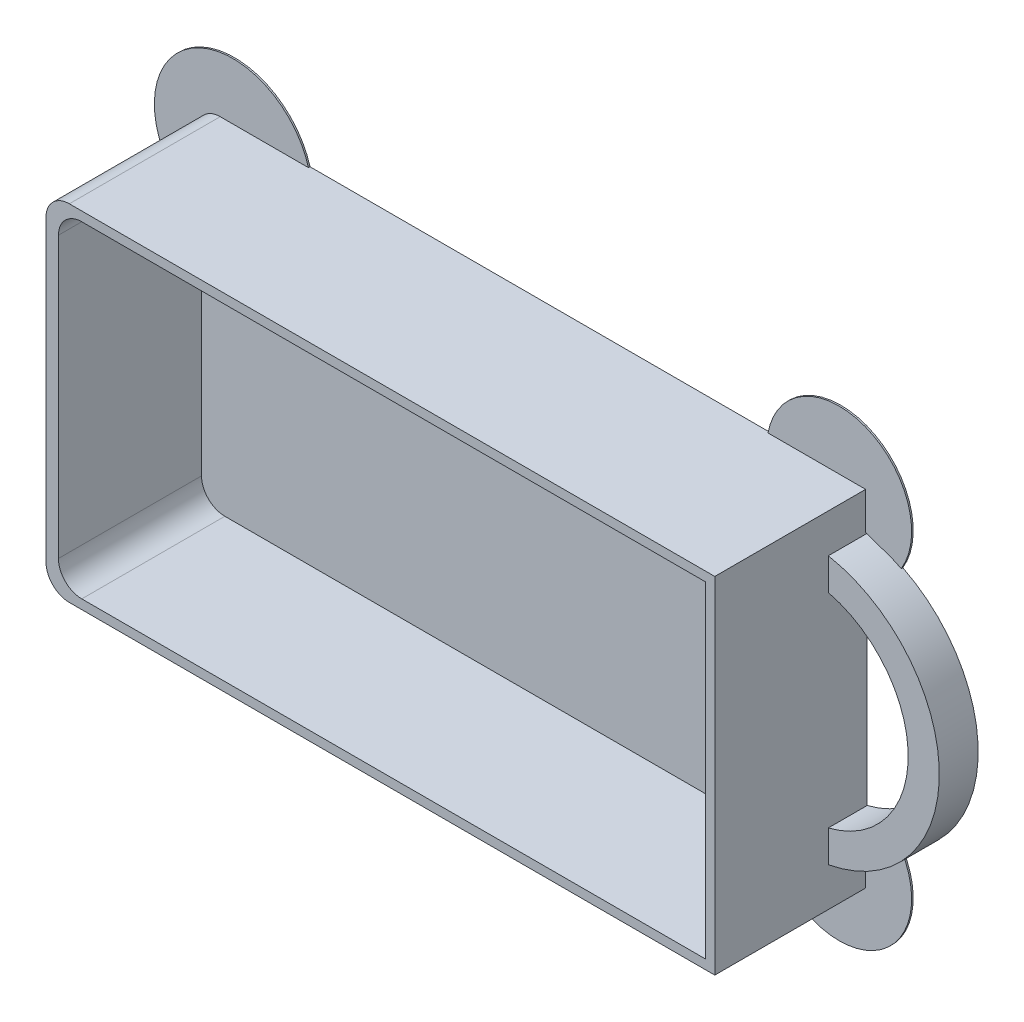
ISO-10303-21;
HEADER;
FILE_DESCRIPTION(('STEP AP214'),'2;1');
FILE_NAME('part.step','',(''),(''),'','','');
FILE_SCHEMA(('AUTOMOTIVE_DESIGN { 1 0 10303 214 1 1 1 1 }'));
ENDSEC;
DATA;
#1=APPLICATION_CONTEXT('core data for automotive mechanical design processes');
#2=APPLICATION_PROTOCOL_DEFINITION('international standard','automotive_design',2000,#1);
#3=PRODUCT_CONTEXT('',#1,'mechanical');
#4=PRODUCT('Part','Part','',(#3));
#5=PRODUCT_RELATED_PRODUCT_CATEGORY('part','',(#4));
#6=PRODUCT_DEFINITION_FORMATION('','',#4);
#7=PRODUCT_DEFINITION_CONTEXT('part definition',#1,'design');
#8=PRODUCT_DEFINITION('design','',#6,#7);
#9=PRODUCT_DEFINITION_SHAPE('','',#8);
#10=(LENGTH_UNIT() NAMED_UNIT(*) SI_UNIT(.MILLI.,.METRE.));
#11=(NAMED_UNIT(*) PLANE_ANGLE_UNIT() SI_UNIT($,.RADIAN.));
#12=(NAMED_UNIT(*) SI_UNIT($,.STERADIAN.) SOLID_ANGLE_UNIT());
#13=UNCERTAINTY_MEASURE_WITH_UNIT(LENGTH_MEASURE(1.E-05),#10,'distance_accuracy_value','');
#14=(GEOMETRIC_REPRESENTATION_CONTEXT(3) GLOBAL_UNCERTAINTY_ASSIGNED_CONTEXT((#13)) GLOBAL_UNIT_ASSIGNED_CONTEXT((#10,
#11,#12)) REPRESENTATION_CONTEXT('',''));
#15=CARTESIAN_POINT('',(0.,0.,0.));
#16=DIRECTION('',(0.,0.,1.));
#17=DIRECTION('',(1.,0.,0.));
#18=AXIS2_PLACEMENT_3D('',#15,#16,#17);
#19=CARTESIAN_POINT('',(-40.,-19.2,19.6));
#20=DIRECTION('',(0.,0.,-1.));
#21=DIRECTION('',(-1.,0.,0.));
#22=AXIS2_PLACEMENT_3D('',#19,#20,#21);
#23=CYLINDRICAL_SURFACE('',#22,3.);
#24=DIRECTION('',(0.,0.,-1.));
#25=VECTOR('',#24,1.);
#26=CARTESIAN_POINT('',(-43.,-19.2,19.6));
#27=LINE('',#26,#25);
#28=CARTESIAN_POINT('',(-43.,-19.2,0.199999999999999));
#29=VERTEX_POINT('',#28);
#30=CARTESIAN_POINT('',(-43.,-19.2,19.6));
#31=VERTEX_POINT('',#30);
#32=EDGE_CURVE('E270',#29,#31,#27,.F.);
#33=ORIENTED_EDGE('',*,*,#32,.F.);
#34=CARTESIAN_POINT('',(-40.,-19.2,0.199999999999999));
#35=DIRECTION('',(0.,0.,-1.));
#36=DIRECTION('',(-1.,0.,0.));
#37=AXIS2_PLACEMENT_3D('',#34,#35,#36);
#38=CIRCLE('',#37,3.);
#39=CARTESIAN_POINT('',(-40.,-22.2,0.199999999999999));
#40=VERTEX_POINT('',#39);
#41=EDGE_CURVE('E12',#29,#40,#38,.F.);
#42=ORIENTED_EDGE('',*,*,#41,.T.);
#43=DIRECTION('',(0.,0.,-1.));
#44=VECTOR('',#43,1.);
#45=CARTESIAN_POINT('',(-40.,-22.2,19.6));
#46=LINE('',#45,#44);
#47=CARTESIAN_POINT('',(-40.,-22.2,19.6));
#48=VERTEX_POINT('',#47);
#49=EDGE_CURVE('E281',#48,#40,#46,.T.);
#50=ORIENTED_EDGE('',*,*,#49,.F.);
#51=CARTESIAN_POINT('',(-40.,-19.2,19.6));
#52=DIRECTION('',(0.,0.,1.));
#53=DIRECTION('',(1.,0.,0.));
#54=AXIS2_PLACEMENT_3D('',#51,#52,#53);
#55=CIRCLE('',#54,3.);
#56=EDGE_CURVE('E277',#31,#48,#55,.T.);
#57=ORIENTED_EDGE('',*,*,#56,.F.);
#58=EDGE_LOOP('',(#33,#42,#50,#57));
#59=FACE_BOUND('',#58,.T.);
#60=ADVANCED_FACE('F41',(#59),#23,.T.);
#61=CARTESIAN_POINT('',(43.,22.2,19.6));
#62=DIRECTION('',(-1.,0.,0.));
#63=DIRECTION('',(0.,-1.,0.));
#64=AXIS2_PLACEMENT_3D('',#61,#62,#63);
#65=PLANE('',#64);
#66=DIRECTION('',(0.,1.,0.));
#67=VECTOR('',#66,1.);
#68=CARTESIAN_POINT('',(43.,22.2,0.));
#69=LINE('',#68,#67);
#70=CARTESIAN_POINT('',(43.,17.2,0.));
#71=VERTEX_POINT('',#70);
#72=CARTESIAN_POINT('',(43.,17.4095957925949,0.));
#73=VERTEX_POINT('',#72);
#74=EDGE_CURVE('E347',#71,#73,#69,.T.);
#75=ORIENTED_EDGE('',*,*,#74,.T.);
#76=DIRECTION('',(0.,0.,1.));
#77=VECTOR('',#76,1.);
#78=CARTESIAN_POINT('',(43.,17.4095957925949,19.6));
#79=LINE('',#78,#77);
#80=CARTESIAN_POINT('',(43.,17.4095957925949,0.199999999999999));
#81=VERTEX_POINT('',#80);
#82=EDGE_CURVE('E56',#73,#81,#79,.T.);
#83=ORIENTED_EDGE('',*,*,#82,.T.);
#84=DIRECTION('',(0.,-1.,0.));
#85=VECTOR('',#84,1.);
#86=CARTESIAN_POINT('',(43.,22.2,0.199999999999999));
#87=LINE('',#86,#85);
#88=CARTESIAN_POINT('',(43.,22.2,0.199999999999999));
#89=VERTEX_POINT('',#88);
#90=EDGE_CURVE('E378',#89,#81,#87,.T.);
#91=ORIENTED_EDGE('',*,*,#90,.F.);
#92=DIRECTION('',(0.,0.,-1.));
#93=VECTOR('',#92,1.);
#94=CARTESIAN_POINT('',(43.,22.2,19.6));
#95=LINE('',#94,#93);
#96=CARTESIAN_POINT('',(43.,22.2,19.6));
#97=VERTEX_POINT('',#96);
#98=EDGE_CURVE('E267',#97,#89,#95,.T.);
#99=ORIENTED_EDGE('',*,*,#98,.F.);
#100=DIRECTION('',(0.,1.,0.));
#101=VECTOR('',#100,1.);
#102=CARTESIAN_POINT('',(43.,22.2,19.6));
#103=LINE('',#102,#101);
#104=CARTESIAN_POINT('',(43.,-22.2,19.6));
#105=VERTEX_POINT('',#104);
#106=EDGE_CURVE('E254',#105,#97,#103,.T.);
#107=ORIENTED_EDGE('',*,*,#106,.F.);
#108=DIRECTION('',(0.,0.,-1.));
#109=VECTOR('',#108,1.);
#110=CARTESIAN_POINT('',(43.,-22.2,19.6));
#111=LINE('',#110,#109);
#112=CARTESIAN_POINT('',(43.,-22.2,0.199999999999999));
#113=VERTEX_POINT('',#112);
#114=EDGE_CURVE('E264',#105,#113,#111,.T.);
#115=ORIENTED_EDGE('',*,*,#114,.T.);
#116=DIRECTION('',(0.,1.,0.));
#117=VECTOR('',#116,1.);
#118=CARTESIAN_POINT('',(43.,22.2,0.199999999999999));
#119=LINE('',#118,#117);
#120=CARTESIAN_POINT('',(43.,-17.4095957925949,0.199999999999999));
#121=VERTEX_POINT('',#120);
#122=EDGE_CURVE('E398',#113,#121,#119,.T.);
#123=ORIENTED_EDGE('',*,*,#122,.T.);
#124=DIRECTION('',(0.,0.,-1.));
#125=VECTOR('',#124,1.);
#126=CARTESIAN_POINT('',(43.,-17.4095957925949,19.6));
#127=LINE('',#126,#125);
#128=CARTESIAN_POINT('',(43.,-17.4095957925949,0.));
#129=VERTEX_POINT('',#128);
#130=EDGE_CURVE('E400',#121,#129,#127,.T.);
#131=ORIENTED_EDGE('',*,*,#130,.T.);
#132=CARTESIAN_POINT('',(43.,-17.2,0.));
#133=VERTEX_POINT('',#132);
#134=EDGE_CURVE('E345',#129,#133,#69,.T.);
#135=ORIENTED_EDGE('',*,*,#134,.T.);
#136=DIRECTION('',(0.,0.,-1.));
#137=VECTOR('',#136,1.);
#138=CARTESIAN_POINT('',(43.,-17.2,5.));
#139=LINE('',#138,#137);
#140=CARTESIAN_POINT('',(43.,-17.2,5.));
#141=VERTEX_POINT('',#140);
#142=EDGE_CURVE('E442',#141,#133,#139,.T.);
#143=ORIENTED_EDGE('',*,*,#142,.F.);
#144=DIRECTION('',(0.,-1.,0.));
#145=VECTOR('',#144,1.);
#146=CARTESIAN_POINT('',(43.,-17.2,5.));
#147=LINE('',#146,#145);
#148=CARTESIAN_POINT('',(43.,-13.1087756865391,5.));
#149=VERTEX_POINT('',#148);
#150=EDGE_CURVE('E439',#149,#141,#147,.T.);
#151=ORIENTED_EDGE('',*,*,#150,.F.);
#152=DIRECTION('',(0.,0.,-1.));
#153=VECTOR('',#152,1.);
#154=CARTESIAN_POINT('',(43.,-13.1087756865391,5.));
#155=LINE('',#154,#153);
#156=CARTESIAN_POINT('',(43.,-13.1087756865391,0.));
#157=VERTEX_POINT('',#156);
#158=EDGE_CURVE('E450',#149,#157,#155,.T.);
#159=ORIENTED_EDGE('',*,*,#158,.T.);
#160=CARTESIAN_POINT('',(43.,13.1087756865391,0.));
#161=VERTEX_POINT('',#160);
#162=EDGE_CURVE('E346',#157,#161,#69,.T.);
#163=ORIENTED_EDGE('',*,*,#162,.T.);
#164=DIRECTION('',(0.,0.,-1.));
#165=VECTOR('',#164,1.);
#166=CARTESIAN_POINT('',(43.,13.1087756865391,5.));
#167=LINE('',#166,#165);
#168=CARTESIAN_POINT('',(43.,13.1087756865391,5.));
#169=VERTEX_POINT('',#168);
#170=EDGE_CURVE('E453',#169,#161,#167,.T.);
#171=ORIENTED_EDGE('',*,*,#170,.F.);
#172=DIRECTION('',(0.,-1.,0.));
#173=VECTOR('',#172,1.);
#174=CARTESIAN_POINT('',(43.,17.2,5.));
#175=LINE('',#174,#173);
#176=CARTESIAN_POINT('',(43.,17.2,5.));
#177=VERTEX_POINT('',#176);
#178=EDGE_CURVE('E432',#177,#169,#175,.T.);
#179=ORIENTED_EDGE('',*,*,#178,.F.);
#180=DIRECTION('',(0.,0.,-1.));
#181=VECTOR('',#180,1.);
#182=CARTESIAN_POINT('',(43.,17.2,5.));
#183=LINE('',#182,#181);
#184=EDGE_CURVE('E456',#177,#71,#183,.T.);
#185=ORIENTED_EDGE('',*,*,#184,.T.);
#186=EDGE_LOOP('',(#75,#83,#91,#99,#107,#115,#123,#131,#135,#143,#151,#159,#163,#171,#179,#185));
#187=FACE_BOUND('',#186,.T.);
#188=ADVANCED_FACE('F460',(#187),#65,.F.);
#189=CARTESIAN_POINT('',(-43.,22.2,19.6));
#190=DIRECTION('',(0.,-1.,0.));
#191=DIRECTION('',(0.,0.,-1.));
#192=AXIS2_PLACEMENT_3D('',#189,#190,#191);
#193=PLANE('',#192);
#194=DIRECTION('',(-1.,0.,0.));
#195=VECTOR('',#194,1.);
#196=CARTESIAN_POINT('',(-43.,22.2,0.));
#197=LINE('',#196,#195);
#198=CARTESIAN_POINT('',(30.4454706503605,22.2,0.));
#199=VERTEX_POINT('',#198);
#200=CARTESIAN_POINT('',(-28.646024870181,22.2,0.));
#201=VERTEX_POINT('',#200);
#202=EDGE_CURVE('E260',#199,#201,#197,.T.);
#203=ORIENTED_EDGE('',*,*,#202,.T.);
#204=DIRECTION('',(0.,0.,-1.));
#205=VECTOR('',#204,1.);
#206=CARTESIAN_POINT('',(-28.646024870181,22.2,0.2));
#207=LINE('',#206,#205);
#208=CARTESIAN_POINT('',(-28.646024870181,22.2,0.2));
#209=VERTEX_POINT('',#208);
#210=EDGE_CURVE('E326',#209,#201,#207,.T.);
#211=ORIENTED_EDGE('',*,*,#210,.F.);
#212=DIRECTION('',(-1.,0.,0.));
#213=VECTOR('',#212,1.);
#214=CARTESIAN_POINT('',(-43.,22.2,0.199999999999999));
#215=LINE('',#214,#213);
#216=CARTESIAN_POINT('',(-40.,22.2,0.199999999999999));
#217=VERTEX_POINT('',#216);
#218=EDGE_CURVE('E315',#209,#217,#215,.T.);
#219=ORIENTED_EDGE('',*,*,#218,.T.);
#220=DIRECTION('',(0.,0.,-1.));
#221=VECTOR('',#220,1.);
#222=CARTESIAN_POINT('',(-40.,22.2,19.6));
#223=LINE('',#222,#221);
#224=CARTESIAN_POINT('',(-40.,22.2,19.6));
#225=VERTEX_POINT('',#224);
#226=EDGE_CURVE('E275',#217,#225,#223,.F.);
#227=ORIENTED_EDGE('',*,*,#226,.T.);
#228=DIRECTION('',(-1.,0.,0.));
#229=VECTOR('',#228,1.);
#230=CARTESIAN_POINT('',(-43.,22.2,19.6));
#231=LINE('',#230,#229);
#232=EDGE_CURVE('E258',#97,#225,#231,.T.);
#233=ORIENTED_EDGE('',*,*,#232,.F.);
#234=ORIENTED_EDGE('',*,*,#98,.T.);
#235=DIRECTION('',(1.,0.,0.));
#236=VECTOR('',#235,1.);
#237=CARTESIAN_POINT('',(-43.,22.2,0.199999999999999));
#238=LINE('',#237,#236);
#239=CARTESIAN_POINT('',(30.4454706503605,22.2,0.199999999999999));
#240=VERTEX_POINT('',#239);
#241=EDGE_CURVE('E64',#240,#89,#238,.T.);
#242=ORIENTED_EDGE('',*,*,#241,.F.);
#243=DIRECTION('',(0.,0.,-1.));
#244=VECTOR('',#243,1.);
#245=CARTESIAN_POINT('',(30.4454706503605,22.2,0.2));
#246=LINE('',#245,#244);
#247=EDGE_CURVE('E327',#240,#199,#246,.T.);
#248=ORIENTED_EDGE('',*,*,#247,.T.);
#249=EDGE_LOOP('',(#203,#211,#219,#227,#233,#234,#242,#248));
#250=FACE_BOUND('',#249,.T.);
#251=ADVANCED_FACE('F324',(#250),#193,.F.);
#252=CARTESIAN_POINT('',(-43.,22.2,19.6));
#253=DIRECTION('',(1.,0.,0.));
#254=DIRECTION('',(0.,1.,0.));
#255=AXIS2_PLACEMENT_3D('',#252,#253,#254);
#256=PLANE('',#255);
#257=DIRECTION('',(0.,-1.,0.));
#258=VECTOR('',#257,1.);
#259=CARTESIAN_POINT('',(-43.,22.2,0.));
#260=LINE('',#259,#258);
#261=CARTESIAN_POINT('',(-43.,10.4177061359249,0.));
#262=VERTEX_POINT('',#261);
#263=CARTESIAN_POINT('',(-43.,-10.4177061359249,0.));
#264=VERTEX_POINT('',#263);
#265=EDGE_CURVE('E255',#262,#264,#260,.T.);
#266=ORIENTED_EDGE('',*,*,#265,.T.);
#267=DIRECTION('',(0.,0.,-1.));
#268=VECTOR('',#267,1.);
#269=CARTESIAN_POINT('',(-43.,-10.4177061359249,0.2));
#270=LINE('',#269,#268);
#271=CARTESIAN_POINT('',(-43.,-10.4177061359249,0.2));
#272=VERTEX_POINT('',#271);
#273=EDGE_CURVE('E234',#272,#264,#270,.T.);
#274=ORIENTED_EDGE('',*,*,#273,.F.);
#275=DIRECTION('',(0.,1.,0.));
#276=VECTOR('',#275,1.);
#277=CARTESIAN_POINT('',(-43.,22.2,0.199999999999999));
#278=LINE('',#277,#276);
#279=EDGE_CURVE('E749',#29,#272,#278,.T.);
#280=ORIENTED_EDGE('',*,*,#279,.F.);
#281=ORIENTED_EDGE('',*,*,#32,.T.);
#282=DIRECTION('',(0.,-1.,0.));
#283=VECTOR('',#282,1.);
#284=CARTESIAN_POINT('',(-43.,22.2,19.6));
#285=LINE('',#284,#283);
#286=CARTESIAN_POINT('',(-43.,19.2,19.6));
#287=VERTEX_POINT('',#286);
#288=EDGE_CURVE('E335',#287,#31,#285,.T.);
#289=ORIENTED_EDGE('',*,*,#288,.F.);
#290=DIRECTION('',(0.,0.,-1.));
#291=VECTOR('',#290,1.);
#292=CARTESIAN_POINT('',(-43.,19.2,19.6));
#293=LINE('',#292,#291);
#294=CARTESIAN_POINT('',(-43.,19.2,0.199999999999999));
#295=VERTEX_POINT('',#294);
#296=EDGE_CURVE('E272',#287,#295,#293,.T.);
#297=ORIENTED_EDGE('',*,*,#296,.T.);
#298=DIRECTION('',(0.,-1.,0.));
#299=VECTOR('',#298,1.);
#300=CARTESIAN_POINT('',(-43.,22.2,0.199999999999999));
#301=LINE('',#300,#299);
#302=CARTESIAN_POINT('',(-43.,10.4177061359249,0.2));
#303=VERTEX_POINT('',#302);
#304=EDGE_CURVE('E318',#295,#303,#301,.T.);
#305=ORIENTED_EDGE('',*,*,#304,.T.);
#306=DIRECTION('',(0.,0.,-1.));
#307=VECTOR('',#306,1.);
#308=CARTESIAN_POINT('',(-43.,10.4177061359249,0.2));
#309=LINE('',#308,#307);
#310=EDGE_CURVE('E360',#303,#262,#309,.T.);
#311=ORIENTED_EDGE('',*,*,#310,.T.);
#312=EDGE_LOOP('',(#266,#274,#280,#281,#289,#297,#305,#311));
#313=FACE_BOUND('',#312,.T.);
#314=ADVANCED_FACE('F338',(#313),#256,.F.);
#315=CARTESIAN_POINT('',(-43.,-22.2,19.6));
#316=DIRECTION('',(0.,1.,0.));
#317=DIRECTION('',(0.,0.,1.));
#318=AXIS2_PLACEMENT_3D('',#315,#316,#317);
#319=PLANE('',#318);
#320=DIRECTION('',(-1.,0.,0.));
#321=VECTOR('',#320,1.);
#322=CARTESIAN_POINT('',(-43.,-22.2,0.199999999999999));
#323=LINE('',#322,#321);
#324=CARTESIAN_POINT('',(-28.646024870181,-22.2,0.2));
#325=VERTEX_POINT('',#324);
#326=EDGE_CURVE('E239',#325,#40,#323,.T.);
#327=ORIENTED_EDGE('',*,*,#326,.F.);
#328=DIRECTION('',(0.,0.,-1.));
#329=VECTOR('',#328,1.);
#330=CARTESIAN_POINT('',(-28.646024870181,-22.2,0.2));
#331=LINE('',#330,#329);
#332=CARTESIAN_POINT('',(-28.646024870181,-22.2,0.));
#333=VERTEX_POINT('',#332);
#334=EDGE_CURVE('E231',#325,#333,#331,.T.);
#335=ORIENTED_EDGE('',*,*,#334,.T.);
#336=DIRECTION('',(1.,0.,0.));
#337=VECTOR('',#336,1.);
#338=CARTESIAN_POINT('',(-43.,-22.2,0.));
#339=LINE('',#338,#337);
#340=CARTESIAN_POINT('',(30.4454706503604,-22.2,0.));
#341=VERTEX_POINT('',#340);
#342=EDGE_CURVE('E245',#333,#341,#339,.T.);
#343=ORIENTED_EDGE('',*,*,#342,.T.);
#344=DIRECTION('',(0.,0.,-1.));
#345=VECTOR('',#344,1.);
#346=CARTESIAN_POINT('',(30.4454706503605,-22.2,0.2));
#347=LINE('',#346,#345);
#348=CARTESIAN_POINT('',(30.4454706503605,-22.2,0.199999999999999));
#349=VERTEX_POINT('',#348);
#350=EDGE_CURVE('E388',#349,#341,#347,.T.);
#351=ORIENTED_EDGE('',*,*,#350,.F.);
#352=DIRECTION('',(1.,0.,0.));
#353=VECTOR('',#352,1.);
#354=CARTESIAN_POINT('',(-43.,-22.2,0.199999999999999));
#355=LINE('',#354,#353);
#356=EDGE_CURVE('E395',#349,#113,#355,.T.);
#357=ORIENTED_EDGE('',*,*,#356,.T.);
#358=ORIENTED_EDGE('',*,*,#114,.F.);
#359=DIRECTION('',(1.,0.,0.));
#360=VECTOR('',#359,1.);
#361=CARTESIAN_POINT('',(-43.,-22.2,19.6));
#362=LINE('',#361,#360);
#363=EDGE_CURVE('E268',#48,#105,#362,.T.);
#364=ORIENTED_EDGE('',*,*,#363,.F.);
#365=ORIENTED_EDGE('',*,*,#49,.T.);
#366=EDGE_LOOP('',(#327,#335,#343,#351,#357,#358,#364,#365));
#367=FACE_BOUND('',#366,.T.);
#368=ADVANCED_FACE('F244',(#367),#319,.F.);
#369=CARTESIAN_POINT('',(0.,0.,19.6));
#370=DIRECTION('',(0.,0.,1.));
#371=DIRECTION('',(1.,0.,0.));
#372=AXIS2_PLACEMENT_3D('',#369,#370,#371);
#373=PLANE('',#372);
#374=DIRECTION('',(0.,-1.,0.));
#375=VECTOR('',#374,1.);
#376=CARTESIAN_POINT('',(-41.4,21.,19.6));
#377=LINE('',#376,#375);
#378=CARTESIAN_POINT('',(-41.4,18.,19.6));
#379=VERTEX_POINT('',#378);
#380=CARTESIAN_POINT('',(-41.4,-18.,19.6));
#381=VERTEX_POINT('',#380);
#382=EDGE_CURVE('E402',#379,#381,#377,.T.);
#383=ORIENTED_EDGE('',*,*,#382,.F.);
#384=CARTESIAN_POINT('',(-38.4,18.,19.6));
#385=DIRECTION('',(0.,0.,1.));
#386=DIRECTION('',(1.,0.,0.));
#387=AXIS2_PLACEMENT_3D('',#384,#385,#386);
#388=CIRCLE('',#387,3.);
#389=CARTESIAN_POINT('',(-38.4,21.,19.6));
#390=VERTEX_POINT('',#389);
#391=EDGE_CURVE('E299',#379,#390,#388,.F.);
#392=ORIENTED_EDGE('',*,*,#391,.T.);
#393=DIRECTION('',(-1.,0.,0.));
#394=VECTOR('',#393,1.);
#395=CARTESIAN_POINT('',(41.8,21.,19.6));
#396=LINE('',#395,#394);
#397=CARTESIAN_POINT('',(41.8,21.,19.6));
#398=VERTEX_POINT('',#397);
#399=EDGE_CURVE('E419',#398,#390,#396,.T.);
#400=ORIENTED_EDGE('',*,*,#399,.F.);
#401=DIRECTION('',(0.,1.,0.));
#402=VECTOR('',#401,1.);
#403=CARTESIAN_POINT('',(41.8,-21.,19.6));
#404=LINE('',#403,#402);
#405=CARTESIAN_POINT('',(41.8,-21.,19.6));
#406=VERTEX_POINT('',#405);
#407=EDGE_CURVE('E416',#406,#398,#404,.T.);
#408=ORIENTED_EDGE('',*,*,#407,.F.);
#409=DIRECTION('',(1.,0.,0.));
#410=VECTOR('',#409,1.);
#411=CARTESIAN_POINT('',(-41.4,-21.,19.6));
#412=LINE('',#411,#410);
#413=CARTESIAN_POINT('',(-38.4,-21.,19.6));
#414=VERTEX_POINT('',#413);
#415=EDGE_CURVE('E414',#414,#406,#412,.T.);
#416=ORIENTED_EDGE('',*,*,#415,.F.);
#417=CARTESIAN_POINT('',(-38.4,-18.,19.6));
#418=DIRECTION('',(0.,0.,1.));
#419=DIRECTION('',(1.,0.,0.));
#420=AXIS2_PLACEMENT_3D('',#417,#418,#419);
#421=CIRCLE('',#420,3.);
#422=EDGE_CURVE('E297',#414,#381,#421,.F.);
#423=ORIENTED_EDGE('',*,*,#422,.T.);
#424=EDGE_LOOP('',(#383,#392,#400,#408,#416,#423));
#425=FACE_BOUND('',#424,.T.);
#426=ORIENTED_EDGE('',*,*,#232,.T.);
#427=CARTESIAN_POINT('',(-40.,19.2,19.6));
#428=DIRECTION('',(0.,0.,1.));
#429=DIRECTION('',(1.,0.,0.));
#430=AXIS2_PLACEMENT_3D('',#427,#428,#429);
#431=CIRCLE('',#430,3.);
#432=EDGE_CURVE('E279',#225,#287,#431,.T.);
#433=ORIENTED_EDGE('',*,*,#432,.T.);
#434=ORIENTED_EDGE('',*,*,#288,.T.);
#435=ORIENTED_EDGE('',*,*,#56,.T.);
#436=ORIENTED_EDGE('',*,*,#363,.T.);
#437=ORIENTED_EDGE('',*,*,#106,.T.);
#438=EDGE_LOOP('',(#426,#433,#434,#435,#436,#437));
#439=FACE_BOUND('',#438,.T.);
#440=ADVANCED_FACE('F334',(#425,#439),#373,.T.);
#441=CARTESIAN_POINT('',(0.,0.,0.));
#442=DIRECTION('',(0.,0.,1.));
#443=DIRECTION('',(1.,0.,0.));
#444=AXIS2_PLACEMENT_3D('',#441,#442,#443);
#445=PLANE('',#444);
#446=CARTESIAN_POINT('',(-38.3580628326126,-19.397220306011,0.));
#447=DIRECTION('',(0.,0.,-1.));
#448=DIRECTION('',(-1.,0.,0.));
#449=AXIS2_PLACEMENT_3D('',#446,#447,#448);
#450=CIRCLE('',#449,10.1083755073083);
#451=EDGE_CURVE('E227',#333,#264,#450,.T.);
#452=ORIENTED_EDGE('',*,*,#451,.T.);
#453=ORIENTED_EDGE('',*,*,#265,.F.);
#454=CARTESIAN_POINT('',(-38.3580628326126,19.397220306011,0.));
#455=DIRECTION('',(0.,0.,-1.));
#456=DIRECTION('',(1.,0.,0.));
#457=AXIS2_PLACEMENT_3D('',#454,#455,#456);
#458=CIRCLE('',#457,10.1083755073083);
#459=EDGE_CURVE('E352',#262,#201,#458,.T.);
#460=ORIENTED_EDGE('',*,*,#459,.T.);
#461=ORIENTED_EDGE('',*,*,#202,.F.);
#462=CARTESIAN_POINT('',(39.5980407277722,20.4606266128769,0.));
#463=DIRECTION('',(0.,0.,-1.));
#464=DIRECTION('',(-1.,0.,0.));
#465=AXIS2_PLACEMENT_3D('',#462,#463,#464);
#466=CIRCLE('',#465,9.31638120740904);
#467=CARTESIAN_POINT('',(47.5828841665883,15.6609147403414,0.));
#468=VERTEX_POINT('',#467);
#469=EDGE_CURVE('E351',#199,#468,#466,.T.);
#470=ORIENTED_EDGE('',*,*,#469,.T.);
#471=CARTESIAN_POINT('',(39.7735468390197,0.,0.));
#472=DIRECTION('',(0.,0.,1.));
#473=DIRECTION('',(1.,0.,0.));
#474=AXIS2_PLACEMENT_3D('',#471,#472,#473);
#475=CIRCLE('',#474,17.5);
#476=CARTESIAN_POINT('',(47.5828841665884,-15.6609147403414,0.));
#477=VERTEX_POINT('',#476);
#478=EDGE_CURVE('E445',#477,#468,#475,.T.);
#479=ORIENTED_EDGE('',*,*,#478,.F.);
#480=CARTESIAN_POINT('',(39.5980407277722,-20.4606266128769,0.));
#481=DIRECTION('',(0.,0.,-1.));
#482=DIRECTION('',(1.,0.,0.));
#483=AXIS2_PLACEMENT_3D('',#480,#481,#482);
#484=CIRCLE('',#483,9.31638120740904);
#485=EDGE_CURVE('E253',#477,#341,#484,.T.);
#486=ORIENTED_EDGE('',*,*,#485,.T.);
#487=ORIENTED_EDGE('',*,*,#342,.F.);
#488=EDGE_LOOP('',(#452,#453,#460,#461,#470,#479,#486,#487));
#489=FACE_BOUND('',#488,.T.);
#490=DIRECTION('',(-0.934296316736965,0.356497394845658,0.));
#491=VECTOR('',#490,1.);
#492=CARTESIAN_POINT('',(47.5828841665884,15.6609147403414,0.));
#493=LINE('',#492,#491);
#494=CARTESIAN_POINT('',(44.3816863928052,16.8823887484217,0.));
#495=VERTEX_POINT('',#494);
#496=EDGE_CURVE('E368',#495,#73,#493,.T.);
#497=ORIENTED_EDGE('',*,*,#496,.T.);
#498=ORIENTED_EDGE('',*,*,#74,.F.);
#499=EDGE_CURVE('E428',#495,#71,#475,.T.);
#500=ORIENTED_EDGE('',*,*,#499,.F.);
#501=EDGE_LOOP('',(#497,#498,#500));
#502=FACE_BOUND('',#501,.T.);
#503=ORIENTED_EDGE('',*,*,#134,.F.);
#504=DIRECTION('',(0.934296316736965,0.356497394845658,0.));
#505=VECTOR('',#504,1.);
#506=CARTESIAN_POINT('',(47.5828841665884,-15.6609147403414,0.));
#507=LINE('',#506,#505);
#508=CARTESIAN_POINT('',(44.3816863928052,-16.8823887484217,0.));
#509=VERTEX_POINT('',#508);
#510=EDGE_CURVE('E385',#129,#509,#507,.T.);
#511=ORIENTED_EDGE('',*,*,#510,.T.);
#512=EDGE_CURVE('E443',#133,#509,#475,.T.);
#513=ORIENTED_EDGE('',*,*,#512,.F.);
#514=EDGE_LOOP('',(#503,#511,#513));
#515=FACE_BOUND('',#514,.T.);
#516=CARTESIAN_POINT('',(39.7735468390197,0.,0.));
#517=DIRECTION('',(0.,0.,-1.));
#518=DIRECTION('',(1.,0.,0.));
#519=AXIS2_PLACEMENT_3D('',#516,#517,#518);
#520=CIRCLE('',#519,13.5);
#521=EDGE_CURVE('E433',#161,#157,#520,.T.);
#522=ORIENTED_EDGE('',*,*,#521,.F.);
#523=ORIENTED_EDGE('',*,*,#162,.F.);
#524=EDGE_LOOP('',(#522,#523));
#525=FACE_BOUND('',#524,.T.);
#526=ADVANCED_FACE('F250',(#489,#502,#515,#525),#445,.F.);
#527=CARTESIAN_POINT('',(39.7735468390197,0.,5.));
#528=DIRECTION('',(0.,0.,-1.));
#529=DIRECTION('',(-1.,0.,0.));
#530=AXIS2_PLACEMENT_3D('',#527,#528,#529);
#531=CYLINDRICAL_SURFACE('',#530,17.5);
#532=CARTESIAN_POINT('',(39.7735468390197,0.,0.2));
#533=DIRECTION('',(0.,0.,-1.));
#534=DIRECTION('',(-1.,0.,0.));
#535=AXIS2_PLACEMENT_3D('',#532,#533,#534);
#536=CIRCLE('',#535,17.5);
#537=CARTESIAN_POINT('',(44.3816863928052,16.8823887484217,0.2));
#538=VERTEX_POINT('',#537);
#539=CARTESIAN_POINT('',(47.5828841665883,15.6609147403414,0.2));
#540=VERTEX_POINT('',#539);
#541=EDGE_CURVE('E305',#538,#540,#536,.T.);
#542=ORIENTED_EDGE('',*,*,#541,.F.);
#543=DIRECTION('',(0.,0.,-1.));
#544=VECTOR('',#543,1.);
#545=CARTESIAN_POINT('',(44.3816863928052,16.8823887484217,5.));
#546=LINE('',#545,#544);
#547=EDGE_CURVE('E308',#538,#495,#546,.T.);
#548=ORIENTED_EDGE('',*,*,#547,.T.);
#549=ORIENTED_EDGE('',*,*,#499,.T.);
#550=ORIENTED_EDGE('',*,*,#184,.F.);
#551=CARTESIAN_POINT('',(39.7735468390197,0.,5.));
#552=DIRECTION('',(0.,0.,1.));
#553=DIRECTION('',(1.,0.,0.));
#554=AXIS2_PLACEMENT_3D('',#551,#552,#553);
#555=CIRCLE('',#554,17.5);
#556=EDGE_CURVE('E429',#141,#177,#555,.T.);
#557=ORIENTED_EDGE('',*,*,#556,.F.);
#558=ORIENTED_EDGE('',*,*,#142,.T.);
#559=ORIENTED_EDGE('',*,*,#512,.T.);
#560=DIRECTION('',(0.,0.,-1.));
#561=VECTOR('',#560,1.);
#562=CARTESIAN_POINT('',(44.3816863928052,-16.8823887484217,5.));
#563=LINE('',#562,#561);
#564=CARTESIAN_POINT('',(44.3816863928052,-16.8823887484217,0.2));
#565=VERTEX_POINT('',#564);
#566=EDGE_CURVE('E303',#509,#565,#563,.F.);
#567=ORIENTED_EDGE('',*,*,#566,.T.);
#568=CARTESIAN_POINT('',(39.7735468390197,0.,0.2));
#569=DIRECTION('',(0.,0.,1.));
#570=DIRECTION('',(1.,0.,0.));
#571=AXIS2_PLACEMENT_3D('',#568,#569,#570);
#572=CIRCLE('',#571,17.5);
#573=CARTESIAN_POINT('',(47.5828841665883,-15.6609147403414,0.2));
#574=VERTEX_POINT('',#573);
#575=EDGE_CURVE('E301',#565,#574,#572,.T.);
#576=ORIENTED_EDGE('',*,*,#575,.T.);
#577=DIRECTION('',(0.,0.,-1.));
#578=VECTOR('',#577,1.);
#579=CARTESIAN_POINT('',(47.5828841665884,-15.6609147403414,0.2));
#580=LINE('',#579,#578);
#581=EDGE_CURVE('E392',#574,#477,#580,.T.);
#582=ORIENTED_EDGE('',*,*,#581,.T.);
#583=ORIENTED_EDGE('',*,*,#478,.T.);
#584=DIRECTION('',(0.,0.,-1.));
#585=VECTOR('',#584,1.);
#586=CARTESIAN_POINT('',(47.5828841665884,15.6609147403414,0.2));
#587=LINE('',#586,#585);
#588=EDGE_CURVE('E363',#540,#468,#587,.T.);
#589=ORIENTED_EDGE('',*,*,#588,.F.);
#590=EDGE_LOOP('',(#542,#548,#549,#550,#557,#558,#559,#567,#576,#582,#583,#589));
#591=FACE_BOUND('',#590,.T.);
#592=ADVANCED_FACE('F468',(#591),#531,.T.);
#593=CARTESIAN_POINT('',(39.7735468390197,0.,5.));
#594=DIRECTION('',(0.,0.,-1.));
#595=DIRECTION('',(-1.,0.,0.));
#596=AXIS2_PLACEMENT_3D('',#593,#594,#595);
#597=CYLINDRICAL_SURFACE('',#596,13.5);
#598=ORIENTED_EDGE('',*,*,#521,.T.);
#599=ORIENTED_EDGE('',*,*,#158,.F.);
#600=CARTESIAN_POINT('',(39.7735468390197,0.,5.));
#601=DIRECTION('',(0.,0.,-1.));
#602=DIRECTION('',(1.,0.,0.));
#603=AXIS2_PLACEMENT_3D('',#600,#601,#602);
#604=CIRCLE('',#603,13.5);
#605=EDGE_CURVE('E436',#169,#149,#604,.T.);
#606=ORIENTED_EDGE('',*,*,#605,.F.);
#607=ORIENTED_EDGE('',*,*,#170,.T.);
#608=EDGE_LOOP('',(#598,#599,#606,#607));
#609=FACE_BOUND('',#608,.T.);
#610=ADVANCED_FACE('F466',(#609),#597,.F.);
#611=CARTESIAN_POINT('',(39.7735468390197,0.,5.));
#612=DIRECTION('',(0.,0.,1.));
#613=DIRECTION('',(1.,0.,0.));
#614=AXIS2_PLACEMENT_3D('',#611,#612,#613);
#615=PLANE('',#614);
#616=ORIENTED_EDGE('',*,*,#556,.T.);
#617=ORIENTED_EDGE('',*,*,#178,.T.);
#618=ORIENTED_EDGE('',*,*,#605,.T.);
#619=ORIENTED_EDGE('',*,*,#150,.T.);
#620=EDGE_LOOP('',(#616,#617,#618,#619));
#621=FACE_BOUND('',#620,.T.);
#622=ADVANCED_FACE('F527',(#621),#615,.T.);
#623=CARTESIAN_POINT('',(-41.4,21.,-93.2));
#624=DIRECTION('',(-1.,0.,0.));
#625=DIRECTION('',(0.,-1.,0.));
#626=AXIS2_PLACEMENT_3D('',#623,#624,#625);
#627=PLANE('',#626);
#628=ORIENTED_EDGE('',*,*,#382,.T.);
#629=DIRECTION('',(0.,0.,1.));
#630=VECTOR('',#629,1.);
#631=CARTESIAN_POINT('',(-41.4,-18.,1.20000000000001));
#632=LINE('',#631,#630);
#633=CARTESIAN_POINT('',(-41.4,-18.,1.20000000000001));
#634=VERTEX_POINT('',#633);
#635=EDGE_CURVE('E289',#381,#634,#632,.F.);
#636=ORIENTED_EDGE('',*,*,#635,.T.);
#637=DIRECTION('',(0.,1.,0.));
#638=VECTOR('',#637,1.);
#639=CARTESIAN_POINT('',(-41.4,21.,1.20000000000001));
#640=LINE('',#639,#638);
#641=CARTESIAN_POINT('',(-41.4,18.,1.20000000000001));
#642=VERTEX_POINT('',#641);
#643=EDGE_CURVE('E408',#634,#642,#640,.T.);
#644=ORIENTED_EDGE('',*,*,#643,.T.);
#645=DIRECTION('',(0.,0.,1.));
#646=VECTOR('',#645,1.);
#647=CARTESIAN_POINT('',(-41.4,18.,19.6));
#648=LINE('',#647,#646);
#649=EDGE_CURVE('E286',#642,#379,#648,.T.);
#650=ORIENTED_EDGE('',*,*,#649,.T.);
#651=EDGE_LOOP('',(#628,#636,#644,#650));
#652=FACE_BOUND('',#651,.T.);
#653=ADVANCED_FACE('F525',(#652),#627,.F.);
#654=CARTESIAN_POINT('',(41.8,21.,-93.2));
#655=DIRECTION('',(0.,1.,0.));
#656=DIRECTION('',(0.,0.,1.));
#657=AXIS2_PLACEMENT_3D('',#654,#655,#656);
#658=PLANE('',#657);
#659=ORIENTED_EDGE('',*,*,#399,.T.);
#660=DIRECTION('',(0.,0.,1.));
#661=VECTOR('',#660,1.);
#662=CARTESIAN_POINT('',(-38.4,21.,1.20000000000001));
#663=LINE('',#662,#661);
#664=CARTESIAN_POINT('',(-38.4,21.,1.20000000000001));
#665=VERTEX_POINT('',#664);
#666=EDGE_CURVE('E295',#390,#665,#663,.F.);
#667=ORIENTED_EDGE('',*,*,#666,.T.);
#668=DIRECTION('',(1.,0.,0.));
#669=VECTOR('',#668,1.);
#670=CARTESIAN_POINT('',(41.8,21.,1.20000000000001));
#671=LINE('',#670,#669);
#672=CARTESIAN_POINT('',(41.8,21.,1.20000000000001));
#673=VERTEX_POINT('',#672);
#674=EDGE_CURVE('E405',#665,#673,#671,.T.);
#675=ORIENTED_EDGE('',*,*,#674,.T.);
#676=DIRECTION('',(0.,0.,1.));
#677=VECTOR('',#676,1.);
#678=CARTESIAN_POINT('',(41.8,21.,-93.2));
#679=LINE('',#678,#677);
#680=EDGE_CURVE('E406',#673,#398,#679,.T.);
#681=ORIENTED_EDGE('',*,*,#680,.T.);
#682=EDGE_LOOP('',(#659,#667,#675,#681));
#683=FACE_BOUND('',#682,.T.);
#684=ADVANCED_FACE('F520',(#683),#658,.F.);
#685=CARTESIAN_POINT('',(41.8,-21.,-93.2));
#686=DIRECTION('',(1.,0.,0.));
#687=DIRECTION('',(0.,1.,0.));
#688=AXIS2_PLACEMENT_3D('',#685,#686,#687);
#689=PLANE('',#688);
#690=DIRECTION('',(0.,-1.,0.));
#691=VECTOR('',#690,1.);
#692=CARTESIAN_POINT('',(41.8,-21.,1.20000000000001));
#693=LINE('',#692,#691);
#694=CARTESIAN_POINT('',(41.8,-21.,1.19999999999998));
#695=VERTEX_POINT('',#694);
#696=EDGE_CURVE('E403',#673,#695,#693,.T.);
#697=ORIENTED_EDGE('',*,*,#696,.T.);
#698=DIRECTION('',(0.,0.,1.));
#699=VECTOR('',#698,1.);
#700=CARTESIAN_POINT('',(41.8,-21.,-93.2));
#701=LINE('',#700,#699);
#702=EDGE_CURVE('E422',#695,#406,#701,.T.);
#703=ORIENTED_EDGE('',*,*,#702,.T.);
#704=ORIENTED_EDGE('',*,*,#407,.T.);
#705=ORIENTED_EDGE('',*,*,#680,.F.);
#706=EDGE_LOOP('',(#697,#703,#704,#705));
#707=FACE_BOUND('',#706,.T.);
#708=ADVANCED_FACE('F514',(#707),#689,.F.);
#709=CARTESIAN_POINT('',(-41.4,-21.,-93.2));
#710=DIRECTION('',(0.,-1.,0.));
#711=DIRECTION('',(0.,0.,-1.));
#712=AXIS2_PLACEMENT_3D('',#709,#710,#711);
#713=PLANE('',#712);
#714=DIRECTION('',(-1.,0.,0.));
#715=VECTOR('',#714,1.);
#716=CARTESIAN_POINT('',(-41.4,-21.,1.20000000000001));
#717=LINE('',#716,#715);
#718=CARTESIAN_POINT('',(-38.4,-21.,1.20000000000001));
#719=VERTEX_POINT('',#718);
#720=EDGE_CURVE('E411',#695,#719,#717,.T.);
#721=ORIENTED_EDGE('',*,*,#720,.T.);
#722=DIRECTION('',(0.,0.,1.));
#723=VECTOR('',#722,1.);
#724=CARTESIAN_POINT('',(-38.4,-21.,19.6));
#725=LINE('',#724,#723);
#726=EDGE_CURVE('E283',#719,#414,#725,.T.);
#727=ORIENTED_EDGE('',*,*,#726,.T.);
#728=ORIENTED_EDGE('',*,*,#415,.T.);
#729=ORIENTED_EDGE('',*,*,#702,.F.);
#730=EDGE_LOOP('',(#721,#727,#728,#729));
#731=FACE_BOUND('',#730,.T.);
#732=ADVANCED_FACE('F510',(#731),#713,.F.);
#733=CARTESIAN_POINT('',(0.,0.,1.2));
#734=DIRECTION('',(0.,0.,1.));
#735=DIRECTION('',(1.,0.,0.));
#736=AXIS2_PLACEMENT_3D('',#733,#734,#735);
#737=PLANE('',#736);
#738=ORIENTED_EDGE('',*,*,#643,.F.);
#739=CARTESIAN_POINT('',(-38.4,-18.,1.20000000000001));
#740=DIRECTION('',(0.,0.,1.));
#741=DIRECTION('',(1.,0.,0.));
#742=AXIS2_PLACEMENT_3D('',#739,#740,#741);
#743=CIRCLE('',#742,3.);
#744=EDGE_CURVE('E293',#634,#719,#743,.T.);
#745=ORIENTED_EDGE('',*,*,#744,.T.);
#746=ORIENTED_EDGE('',*,*,#720,.F.);
#747=ORIENTED_EDGE('',*,*,#696,.F.);
#748=ORIENTED_EDGE('',*,*,#674,.F.);
#749=CARTESIAN_POINT('',(-38.4,18.,1.20000000000001));
#750=DIRECTION('',(0.,0.,1.));
#751=DIRECTION('',(1.,0.,0.));
#752=AXIS2_PLACEMENT_3D('',#749,#750,#751);
#753=CIRCLE('',#752,3.);
#754=EDGE_CURVE('E291',#665,#642,#753,.T.);
#755=ORIENTED_EDGE('',*,*,#754,.T.);
#756=EDGE_LOOP('',(#738,#745,#746,#747,#748,#755));
#757=FACE_BOUND('',#756,.T.);
#758=ADVANCED_FACE('F500',(#757),#737,.T.);
#759=CARTESIAN_POINT('',(-40.,19.2,19.6));
#760=DIRECTION('',(0.,0.,-1.));
#761=DIRECTION('',(-1.,0.,0.));
#762=AXIS2_PLACEMENT_3D('',#759,#760,#761);
#763=CYLINDRICAL_SURFACE('',#762,3.);
#764=CARTESIAN_POINT('',(-40.,19.2,0.199999999999999));
#765=DIRECTION('',(0.,0.,1.));
#766=DIRECTION('',(1.,0.,0.));
#767=AXIS2_PLACEMENT_3D('',#764,#765,#766);
#768=CIRCLE('',#767,3.);
#769=EDGE_CURVE('E49',#295,#217,#768,.F.);
#770=ORIENTED_EDGE('',*,*,#769,.F.);
#771=ORIENTED_EDGE('',*,*,#296,.F.);
#772=ORIENTED_EDGE('',*,*,#432,.F.);
#773=ORIENTED_EDGE('',*,*,#226,.F.);
#774=EDGE_LOOP('',(#770,#771,#772,#773));
#775=FACE_BOUND('',#774,.T.);
#776=ADVANCED_FACE('F330',(#775),#763,.T.);
#777=CARTESIAN_POINT('',(-38.4,-18.,-93.2));
#778=DIRECTION('',(0.,0.,-1.));
#779=DIRECTION('',(-1.,0.,0.));
#780=AXIS2_PLACEMENT_3D('',#777,#778,#779);
#781=CYLINDRICAL_SURFACE('',#780,3.);
#782=ORIENTED_EDGE('',*,*,#744,.F.);
#783=ORIENTED_EDGE('',*,*,#635,.F.);
#784=ORIENTED_EDGE('',*,*,#422,.F.);
#785=ORIENTED_EDGE('',*,*,#726,.F.);
#786=EDGE_LOOP('',(#782,#783,#784,#785));
#787=FACE_BOUND('',#786,.T.);
#788=ADVANCED_FACE('F490',(#787),#781,.F.);
#789=CARTESIAN_POINT('',(-38.4,18.,-93.2));
#790=DIRECTION('',(0.,0.,-1.));
#791=DIRECTION('',(-1.,0.,0.));
#792=AXIS2_PLACEMENT_3D('',#789,#790,#791);
#793=CYLINDRICAL_SURFACE('',#792,3.);
#794=ORIENTED_EDGE('',*,*,#754,.F.);
#795=ORIENTED_EDGE('',*,*,#666,.F.);
#796=ORIENTED_EDGE('',*,*,#391,.F.);
#797=ORIENTED_EDGE('',*,*,#649,.F.);
#798=EDGE_LOOP('',(#794,#795,#796,#797));
#799=FACE_BOUND('',#798,.T.);
#800=ADVANCED_FACE('F43',(#799),#793,.F.);
#801=CARTESIAN_POINT('',(47.5828841665884,-15.6609147403414,0.2));
#802=DIRECTION('',(-0.356497394845658,0.934296316736965,0.));
#803=DIRECTION('',(-0.934296316736965,-0.356497394845658,0.));
#804=AXIS2_PLACEMENT_3D('',#801,#802,#803);
#805=PLANE('',#804);
#806=ORIENTED_EDGE('',*,*,#130,.F.);
#807=DIRECTION('',(0.934296316736965,0.356497394845658,0.));
#808=VECTOR('',#807,1.);
#809=CARTESIAN_POINT('',(47.5828841665884,-15.6609147403414,0.2));
#810=LINE('',#809,#808);
#811=EDGE_CURVE('E384',#121,#565,#810,.T.);
#812=ORIENTED_EDGE('',*,*,#811,.T.);
#813=ORIENTED_EDGE('',*,*,#566,.F.);
#814=ORIENTED_EDGE('',*,*,#510,.F.);
#815=EDGE_LOOP('',(#806,#812,#813,#814));
#816=FACE_BOUND('',#815,.T.);
#817=ADVANCED_FACE('F497',(#816),#805,.T.);
#818=CARTESIAN_POINT('',(39.5980407277722,-20.4606266128769,0.2));
#819=DIRECTION('',(0.,0.,-1.));
#820=DIRECTION('',(-1.,0.,0.));
#821=AXIS2_PLACEMENT_3D('',#818,#819,#820);
#822=CYLINDRICAL_SURFACE('',#821,9.31638120740904);
#823=ORIENTED_EDGE('',*,*,#485,.F.);
#824=ORIENTED_EDGE('',*,*,#581,.F.);
#825=CARTESIAN_POINT('',(39.5980407277722,-20.4606266128769,0.2));
#826=DIRECTION('',(0.,0.,-1.));
#827=DIRECTION('',(1.,0.,0.));
#828=AXIS2_PLACEMENT_3D('',#825,#826,#827);
#829=CIRCLE('',#828,9.31638120740904);
#830=EDGE_CURVE('E381',#574,#349,#829,.T.);
#831=ORIENTED_EDGE('',*,*,#830,.T.);
#832=ORIENTED_EDGE('',*,*,#350,.T.);
#833=EDGE_LOOP('',(#823,#824,#831,#832));
#834=FACE_BOUND('',#833,.T.);
#835=ADVANCED_FACE('F642',(#834),#822,.T.);
#836=CARTESIAN_POINT('',(39.5980407277722,-20.4606266128769,0.2));
#837=DIRECTION('',(0.,0.,1.));
#838=DIRECTION('',(1.,0.,0.));
#839=AXIS2_PLACEMENT_3D('',#836,#837,#838);
#840=PLANE('',#839);
#841=ORIENTED_EDGE('',*,*,#122,.F.);
#842=ORIENTED_EDGE('',*,*,#356,.F.);
#843=ORIENTED_EDGE('',*,*,#830,.F.);
#844=ORIENTED_EDGE('',*,*,#575,.F.);
#845=ORIENTED_EDGE('',*,*,#811,.F.);
#846=EDGE_LOOP('',(#841,#842,#843,#844,#845));
#847=FACE_BOUND('',#846,.T.);
#848=ADVANCED_FACE('F653',(#847),#840,.T.);
#849=CARTESIAN_POINT('',(47.5828841665884,15.6609147403414,0.2));
#850=DIRECTION('',(-0.356497394845658,-0.934296316736965,0.));
#851=DIRECTION('',(0.934296316736965,-0.356497394845658,0.));
#852=AXIS2_PLACEMENT_3D('',#849,#850,#851);
#853=PLANE('',#852);
#854=ORIENTED_EDGE('',*,*,#82,.F.);
#855=ORIENTED_EDGE('',*,*,#496,.F.);
#856=ORIENTED_EDGE('',*,*,#547,.F.);
#857=DIRECTION('',(-0.934296316736965,0.356497394845658,0.));
#858=VECTOR('',#857,1.);
#859=CARTESIAN_POINT('',(47.5828841665884,15.6609147403414,0.2));
#860=LINE('',#859,#858);
#861=EDGE_CURVE('E366',#538,#81,#860,.T.);
#862=ORIENTED_EDGE('',*,*,#861,.T.);
#863=EDGE_LOOP('',(#854,#855,#856,#862));
#864=FACE_BOUND('',#863,.T.);
#865=ADVANCED_FACE('F664',(#864),#853,.T.);
#866=CARTESIAN_POINT('',(39.5980407277722,20.4606266128769,0.2));
#867=DIRECTION('',(0.,0.,-1.));
#868=DIRECTION('',(-1.,0.,0.));
#869=AXIS2_PLACEMENT_3D('',#866,#867,#868);
#870=CYLINDRICAL_SURFACE('',#869,9.31638120740904);
#871=ORIENTED_EDGE('',*,*,#469,.F.);
#872=ORIENTED_EDGE('',*,*,#247,.F.);
#873=CARTESIAN_POINT('',(39.5980407277722,20.4606266128769,0.2));
#874=DIRECTION('',(0.,0.,-1.));
#875=DIRECTION('',(-1.,0.,0.));
#876=AXIS2_PLACEMENT_3D('',#873,#874,#875);
#877=CIRCLE('',#876,9.31638120740904);
#878=EDGE_CURVE('E371',#240,#540,#877,.T.);
#879=ORIENTED_EDGE('',*,*,#878,.T.);
#880=ORIENTED_EDGE('',*,*,#588,.T.);
#881=EDGE_LOOP('',(#871,#872,#879,#880));
#882=FACE_BOUND('',#881,.T.);
#883=ADVANCED_FACE('F675',(#882),#870,.T.);
#884=CARTESIAN_POINT('',(39.5980407277722,20.4606266128769,0.2));
#885=DIRECTION('',(0.,0.,-1.));
#886=DIRECTION('',(-1.,0.,0.));
#887=AXIS2_PLACEMENT_3D('',#884,#885,#886);
#888=PLANE('',#887);
#889=ORIENTED_EDGE('',*,*,#241,.T.);
#890=ORIENTED_EDGE('',*,*,#90,.T.);
#891=ORIENTED_EDGE('',*,*,#861,.F.);
#892=ORIENTED_EDGE('',*,*,#541,.T.);
#893=ORIENTED_EDGE('',*,*,#878,.F.);
#894=EDGE_LOOP('',(#889,#890,#891,#892,#893));
#895=FACE_BOUND('',#894,.T.);
#896=ADVANCED_FACE('F686',(#895),#888,.F.);
#897=CARTESIAN_POINT('',(-38.3580628326126,19.397220306011,0.2));
#898=DIRECTION('',(0.,0.,1.));
#899=DIRECTION('',(1.,0.,0.));
#900=AXIS2_PLACEMENT_3D('',#897,#898,#899);
#901=PLANE('',#900);
#902=ORIENTED_EDGE('',*,*,#218,.F.);
#903=CARTESIAN_POINT('',(-38.3580628326126,19.397220306011,0.2));
#904=DIRECTION('',(0.,0.,-1.));
#905=DIRECTION('',(1.,0.,0.));
#906=AXIS2_PLACEMENT_3D('',#903,#904,#905);
#907=CIRCLE('',#906,10.1083755073083);
#908=EDGE_CURVE('E355',#303,#209,#907,.T.);
#909=ORIENTED_EDGE('',*,*,#908,.F.);
#910=ORIENTED_EDGE('',*,*,#304,.F.);
#911=ORIENTED_EDGE('',*,*,#769,.T.);
#912=EDGE_LOOP('',(#902,#909,#910,#911));
#913=FACE_BOUND('',#912,.T.);
#914=ADVANCED_FACE('F313',(#913),#901,.T.);
#915=CARTESIAN_POINT('',(-38.3580628326126,19.397220306011,0.2));
#916=DIRECTION('',(0.,0.,-1.));
#917=DIRECTION('',(-1.,0.,0.));
#918=AXIS2_PLACEMENT_3D('',#915,#916,#917);
#919=CYLINDRICAL_SURFACE('',#918,10.1083755073083);
#920=ORIENTED_EDGE('',*,*,#459,.F.);
#921=ORIENTED_EDGE('',*,*,#310,.F.);
#922=ORIENTED_EDGE('',*,*,#908,.T.);
#923=ORIENTED_EDGE('',*,*,#210,.T.);
#924=EDGE_LOOP('',(#920,#921,#922,#923));
#925=FACE_BOUND('',#924,.T.);
#926=ADVANCED_FACE('F707',(#925),#919,.T.);
#927=CARTESIAN_POINT('',(-38.3580628326126,-19.397220306011,0.2));
#928=DIRECTION('',(0.,0.,-1.));
#929=DIRECTION('',(-1.,0.,0.));
#930=AXIS2_PLACEMENT_3D('',#927,#928,#929);
#931=PLANE('',#930);
#932=ORIENTED_EDGE('',*,*,#41,.F.);
#933=ORIENTED_EDGE('',*,*,#279,.T.);
#934=CARTESIAN_POINT('',(-38.3580628326126,-19.397220306011,0.2));
#935=DIRECTION('',(0.,0.,-1.));
#936=DIRECTION('',(-1.,0.,0.));
#937=AXIS2_PLACEMENT_3D('',#934,#935,#936);
#938=CIRCLE('',#937,10.1083755073083);
#939=EDGE_CURVE('E240',#325,#272,#938,.T.);
#940=ORIENTED_EDGE('',*,*,#939,.F.);
#941=ORIENTED_EDGE('',*,*,#326,.T.);
#942=EDGE_LOOP('',(#932,#933,#940,#941));
#943=FACE_BOUND('',#942,.T.);
#944=ADVANCED_FACE('F717',(#943),#931,.F.);
#945=CARTESIAN_POINT('',(-38.3580628326126,-19.397220306011,0.2));
#946=DIRECTION('',(0.,0.,-1.));
#947=DIRECTION('',(-1.,0.,0.));
#948=AXIS2_PLACEMENT_3D('',#945,#946,#947);
#949=CYLINDRICAL_SURFACE('',#948,10.1083755073083);
#950=ORIENTED_EDGE('',*,*,#451,.F.);
#951=ORIENTED_EDGE('',*,*,#334,.F.);
#952=ORIENTED_EDGE('',*,*,#939,.T.);
#953=ORIENTED_EDGE('',*,*,#273,.T.);
#954=EDGE_LOOP('',(#950,#951,#952,#953));
#955=FACE_BOUND('',#954,.T.);
#956=ADVANCED_FACE('F229',(#955),#949,.T.);
#957=CLOSED_SHELL('',(#60,#188,#251,#314,#368,#440,#526,#592,#610,#622,#653,#684,#708,#732,#758,
#776,#788,#800,#817,#835,#848,#865,#883,#896,#914,#926,#944,#956));
#958=MANIFOLD_SOLID_BREP('B2',#957);
#959=ADVANCED_BREP_SHAPE_REPRESENTATION('',(#18,#958),#14);
#960=SHAPE_DEFINITION_REPRESENTATION(#9,#959);
ENDSEC;
END-ISO-10303-21;
